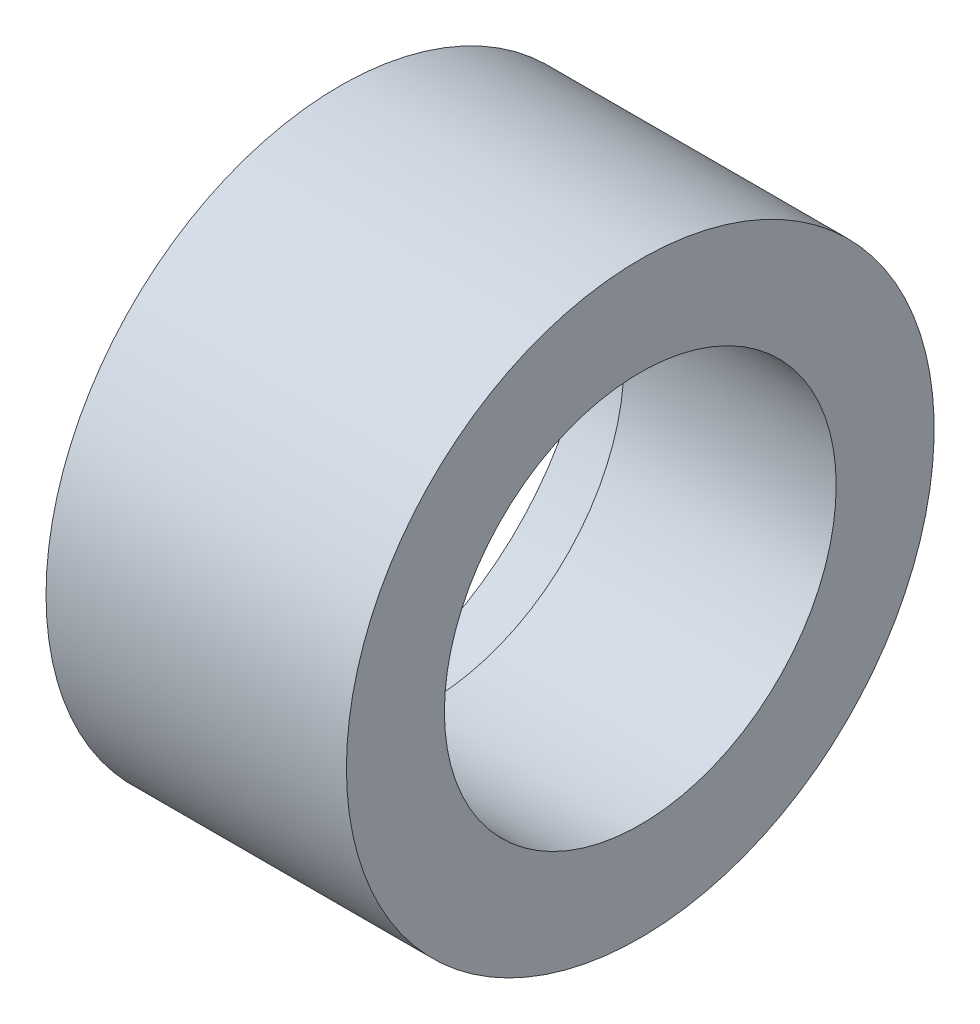
ISO-10303-21;
HEADER;
FILE_DESCRIPTION(('STEP AP214'),'2;1');
FILE_NAME('part.step','',(''),(''),'','','');
FILE_SCHEMA(('AUTOMOTIVE_DESIGN { 1 0 10303 214 1 1 1 1 }'));
ENDSEC;
DATA;
#1=APPLICATION_CONTEXT('core data for automotive mechanical design processes');
#2=APPLICATION_PROTOCOL_DEFINITION('international standard','automotive_design',2000,#1);
#3=PRODUCT_CONTEXT('',#1,'mechanical');
#4=PRODUCT('Part','Part','',(#3));
#5=PRODUCT_RELATED_PRODUCT_CATEGORY('part','',(#4));
#6=PRODUCT_DEFINITION_FORMATION('','',#4);
#7=PRODUCT_DEFINITION_CONTEXT('part definition',#1,'design');
#8=PRODUCT_DEFINITION('design','',#6,#7);
#9=PRODUCT_DEFINITION_SHAPE('','',#8);
#10=(LENGTH_UNIT() NAMED_UNIT(*) SI_UNIT(.MILLI.,.METRE.));
#11=(NAMED_UNIT(*) PLANE_ANGLE_UNIT() SI_UNIT($,.RADIAN.));
#12=(NAMED_UNIT(*) SI_UNIT($,.STERADIAN.) SOLID_ANGLE_UNIT());
#13=UNCERTAINTY_MEASURE_WITH_UNIT(LENGTH_MEASURE(1.E-05),#10,'distance_accuracy_value','');
#14=(GEOMETRIC_REPRESENTATION_CONTEXT(3) GLOBAL_UNCERTAINTY_ASSIGNED_CONTEXT((#13)) GLOBAL_UNIT_ASSIGNED_CONTEXT((#10,
#11,#12)) REPRESENTATION_CONTEXT('',''));
#15=CARTESIAN_POINT('',(0.,0.,0.));
#16=DIRECTION('',(0.,0.,1.));
#17=DIRECTION('',(1.,0.,0.));
#18=AXIS2_PLACEMENT_3D('',#15,#16,#17);
#19=CARTESIAN_POINT('',(227.370475165962,-148.573704322227,0.));
#20=DIRECTION('',(-1.,0.,0.));
#21=DIRECTION('',(0.,0.,1.));
#22=AXIS2_PLACEMENT_3D('',#19,#20,#21);
#23=CYLINDRICAL_SURFACE('',#22,6.00000000000001);
#24=CARTESIAN_POINT('',(259.885153787935,-148.573704322227,0.));
#25=DIRECTION('',(-1.,0.,0.));
#26=DIRECTION('',(0.,0.,1.));
#27=AXIS2_PLACEMENT_3D('',#24,#25,#26);
#28=CIRCLE('',#27,6.00000000000001);
#29=CARTESIAN_POINT('',(259.885153787935,-148.573704322227,6.00000000000001));
#30=VERTEX_POINT('',#29);
#31=EDGE_CURVE('E10',#30,#30,#28,.T.);
#32=ORIENTED_EDGE('',*,*,#31,.F.);
#33=EDGE_LOOP('',(#32));
#34=FACE_BOUND('',#33,.T.);
#35=CARTESIAN_POINT('',(253.385153787935,-148.573704322227,0.));
#36=DIRECTION('',(-1.,0.,0.));
#37=DIRECTION('',(0.,0.,1.));
#38=AXIS2_PLACEMENT_3D('',#35,#36,#37);
#39=CIRCLE('',#38,6.00000000000001);
#40=CARTESIAN_POINT('',(253.385153787935,-148.573704322227,6.00000000000001));
#41=VERTEX_POINT('',#40);
#42=EDGE_CURVE('E59',#41,#41,#39,.T.);
#43=ORIENTED_EDGE('',*,*,#42,.T.);
#44=EDGE_LOOP('',(#43));
#45=FACE_BOUND('',#44,.T.);
#46=ADVANCED_FACE('F37',(#34,#45),#23,.F.);
#47=CARTESIAN_POINT('',(259.885153787935,0.,0.));
#48=DIRECTION('',(-1.,0.,0.));
#49=DIRECTION('',(0.,0.,1.));
#50=AXIS2_PLACEMENT_3D('',#47,#48,#49);
#51=PLANE('',#50);
#52=CARTESIAN_POINT('',(259.885153787935,-148.573704322227,0.));
#53=DIRECTION('',(-1.,0.,0.));
#54=DIRECTION('',(0.,0.,1.));
#55=AXIS2_PLACEMENT_3D('',#52,#53,#54);
#56=CIRCLE('',#55,9.00000000000001);
#57=CARTESIAN_POINT('',(259.885153787935,-148.573704322227,9.00000000000001));
#58=VERTEX_POINT('',#57);
#59=EDGE_CURVE('E43',#58,#58,#56,.T.);
#60=ORIENTED_EDGE('',*,*,#59,.F.);
#61=EDGE_LOOP('',(#60));
#62=FACE_BOUND('',#61,.T.);
#63=ORIENTED_EDGE('',*,*,#31,.T.);
#64=EDGE_LOOP('',(#63));
#65=FACE_BOUND('',#64,.T.);
#66=ADVANCED_FACE('F76',(#62,#65),#51,.F.);
#67=CARTESIAN_POINT('',(227.370475165962,-148.573704322227,0.));
#68=DIRECTION('',(-1.,0.,0.));
#69=DIRECTION('',(0.,0.,1.));
#70=AXIS2_PLACEMENT_3D('',#67,#68,#69);
#71=CYLINDRICAL_SURFACE('',#70,9.00000000000001);
#72=ORIENTED_EDGE('',*,*,#59,.T.);
#73=EDGE_LOOP('',(#72));
#74=FACE_BOUND('',#73,.T.);
#75=CARTESIAN_POINT('',(250.685153787935,-148.573704322227,0.));
#76=DIRECTION('',(-1.,0.,0.));
#77=DIRECTION('',(0.,0.,1.));
#78=AXIS2_PLACEMENT_3D('',#75,#76,#77);
#79=CIRCLE('',#78,9.00000000000001);
#80=CARTESIAN_POINT('',(250.685153787935,-148.573704322227,9.00000000000001));
#81=VERTEX_POINT('',#80);
#82=EDGE_CURVE('E47',#81,#81,#79,.T.);
#83=ORIENTED_EDGE('',*,*,#82,.F.);
#84=EDGE_LOOP('',(#83));
#85=FACE_BOUND('',#84,.T.);
#86=ADVANCED_FACE('F81',(#74,#85),#71,.T.);
#87=CARTESIAN_POINT('',(250.685153787935,0.,0.));
#88=DIRECTION('',(1.,0.,0.));
#89=DIRECTION('',(0.,0.,-1.));
#90=AXIS2_PLACEMENT_3D('',#87,#88,#89);
#91=PLANE('',#90);
#92=CARTESIAN_POINT('',(250.685153787935,-148.573704322227,0.));
#93=DIRECTION('',(-1.,0.,0.));
#94=DIRECTION('',(0.,0.,1.));
#95=AXIS2_PLACEMENT_3D('',#92,#93,#94);
#96=CIRCLE('',#95,7.70000000000001);
#97=CARTESIAN_POINT('',(250.685153787935,-148.573704322227,7.70000000000001));
#98=VERTEX_POINT('',#97);
#99=EDGE_CURVE('E51',#98,#98,#96,.T.);
#100=ORIENTED_EDGE('',*,*,#99,.F.);
#101=EDGE_LOOP('',(#100));
#102=FACE_BOUND('',#101,.T.);
#103=ORIENTED_EDGE('',*,*,#82,.T.);
#104=EDGE_LOOP('',(#103));
#105=FACE_BOUND('',#104,.T.);
#106=ADVANCED_FACE('F72',(#102,#105),#91,.F.);
#107=CARTESIAN_POINT('',(227.370475165962,-148.573704322227,0.));
#108=DIRECTION('',(-1.,0.,0.));
#109=DIRECTION('',(0.,0.,1.));
#110=AXIS2_PLACEMENT_3D('',#107,#108,#109);
#111=CYLINDRICAL_SURFACE('',#110,7.70000000000001);
#112=CARTESIAN_POINT('',(253.385153787935,-148.573704322227,0.));
#113=DIRECTION('',(-1.,0.,0.));
#114=DIRECTION('',(0.,0.,1.));
#115=AXIS2_PLACEMENT_3D('',#112,#113,#114);
#116=CIRCLE('',#115,7.70000000000001);
#117=CARTESIAN_POINT('',(253.385153787935,-148.573704322227,7.70000000000001));
#118=VERTEX_POINT('',#117);
#119=EDGE_CURVE('E56',#118,#118,#116,.T.);
#120=ORIENTED_EDGE('',*,*,#119,.F.);
#121=EDGE_LOOP('',(#120));
#122=FACE_BOUND('',#121,.T.);
#123=ORIENTED_EDGE('',*,*,#99,.T.);
#124=EDGE_LOOP('',(#123));
#125=FACE_BOUND('',#124,.T.);
#126=ADVANCED_FACE('F66',(#122,#125),#111,.F.);
#127=CARTESIAN_POINT('',(253.385153787935,0.,0.));
#128=DIRECTION('',(-1.,0.,0.));
#129=DIRECTION('',(0.,0.,1.));
#130=AXIS2_PLACEMENT_3D('',#127,#128,#129);
#131=PLANE('',#130);
#132=ORIENTED_EDGE('',*,*,#119,.T.);
#133=EDGE_LOOP('',(#132));
#134=FACE_BOUND('',#133,.T.);
#135=ORIENTED_EDGE('',*,*,#42,.F.);
#136=EDGE_LOOP('',(#135));
#137=FACE_BOUND('',#136,.T.);
#138=ADVANCED_FACE('F64',(#134,#137),#131,.T.);
#139=CLOSED_SHELL('',(#46,#66,#86,#106,#126,#138));
#140=MANIFOLD_SOLID_BREP('B2',#139);
#141=ADVANCED_BREP_SHAPE_REPRESENTATION('',(#18,#140),#14);
#142=SHAPE_DEFINITION_REPRESENTATION(#9,#141);
ENDSEC;
END-ISO-10303-21;
